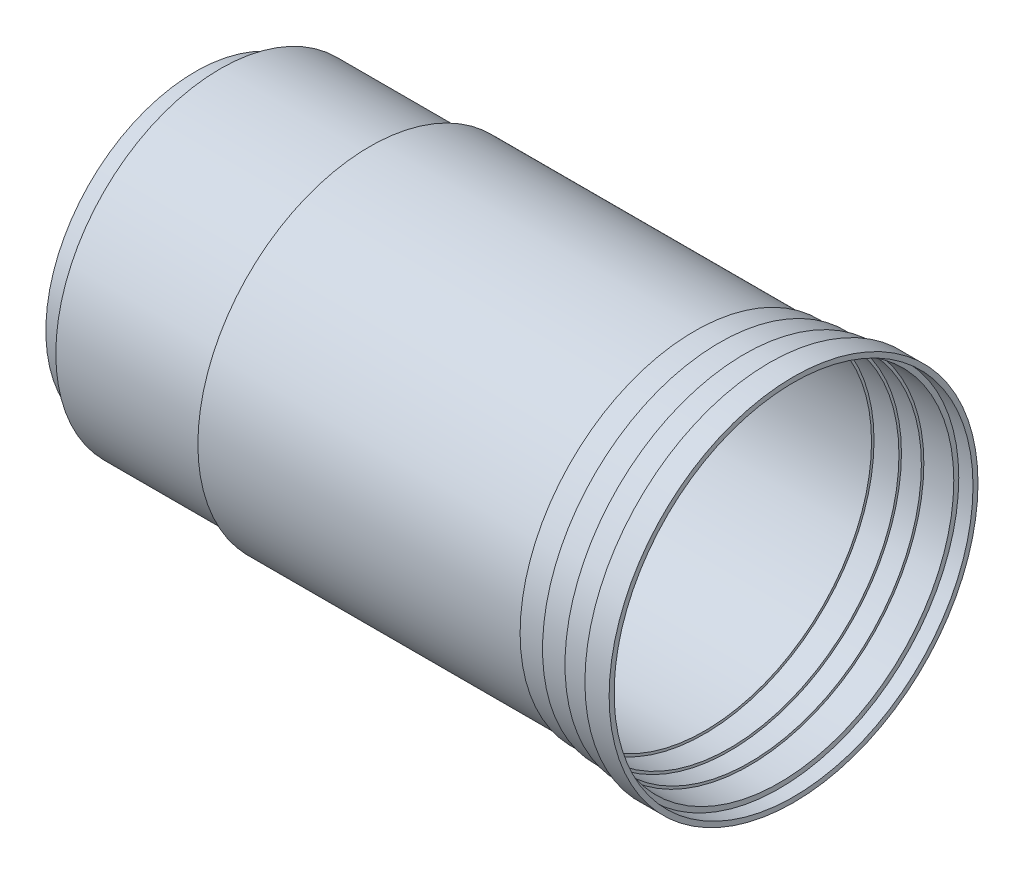
ISO-10303-21;
HEADER;
FILE_DESCRIPTION(('STEP AP214'),'2;1');
FILE_NAME('part.step','',(''),(''),'','','');
FILE_SCHEMA(('AUTOMOTIVE_DESIGN { 1 0 10303 214 1 1 1 1 }'));
ENDSEC;
DATA;
#1=APPLICATION_CONTEXT('core data for automotive mechanical design processes');
#2=APPLICATION_PROTOCOL_DEFINITION('international standard','automotive_design',2000,#1);
#3=PRODUCT_CONTEXT('',#1,'mechanical');
#4=PRODUCT('Part','Part','',(#3));
#5=PRODUCT_RELATED_PRODUCT_CATEGORY('part','',(#4));
#6=PRODUCT_DEFINITION_FORMATION('','',#4);
#7=PRODUCT_DEFINITION_CONTEXT('part definition',#1,'design');
#8=PRODUCT_DEFINITION('design','',#6,#7);
#9=PRODUCT_DEFINITION_SHAPE('','',#8);
#10=(LENGTH_UNIT() NAMED_UNIT(*) SI_UNIT(.MILLI.,.METRE.));
#11=(NAMED_UNIT(*) PLANE_ANGLE_UNIT() SI_UNIT($,.RADIAN.));
#12=(NAMED_UNIT(*) SI_UNIT($,.STERADIAN.) SOLID_ANGLE_UNIT());
#13=UNCERTAINTY_MEASURE_WITH_UNIT(LENGTH_MEASURE(1.E-05),#10,'distance_accuracy_value','');
#14=(GEOMETRIC_REPRESENTATION_CONTEXT(3) GLOBAL_UNCERTAINTY_ASSIGNED_CONTEXT((#13)) GLOBAL_UNIT_ASSIGNED_CONTEXT((#10,
#11,#12)) REPRESENTATION_CONTEXT('',''));
#15=CARTESIAN_POINT('',(0.,0.,0.));
#16=DIRECTION('',(0.,0.,1.));
#17=DIRECTION('',(1.,0.,0.));
#18=AXIS2_PLACEMENT_3D('',#15,#16,#17);
#19=CARTESIAN_POINT('',(-119.,0.,0.));
#20=DIRECTION('',(1.,0.,0.));
#21=DIRECTION('',(0.,0.,-1.));
#22=AXIS2_PLACEMENT_3D('',#19,#20,#21);
#23=PLANE('',#22);
#24=CARTESIAN_POINT('',(-119.,0.,0.));
#25=DIRECTION('',(1.,0.,0.));
#26=DIRECTION('',(0.,0.,-1.));
#27=AXIS2_PLACEMENT_3D('',#24,#25,#26);
#28=CIRCLE('',#27,29.);
#29=CARTESIAN_POINT('',(-119.,0.,-29.));
#30=VERTEX_POINT('',#29);
#31=EDGE_CURVE('E10',#30,#30,#28,.T.);
#32=ORIENTED_EDGE('',*,*,#31,.T.);
#33=EDGE_LOOP('',(#32));
#34=FACE_BOUND('',#33,.T.);
#35=ADVANCED_FACE('F32',(#34),#23,.T.);
#36=CARTESIAN_POINT('',(0.,0.,0.));
#37=DIRECTION('',(1.,0.,0.));
#38=DIRECTION('',(0.,0.,-1.));
#39=AXIS2_PLACEMENT_3D('',#36,#37,#38);
#40=CYLINDRICAL_SURFACE('',#39,29.);
#41=CARTESIAN_POINT('',(-114.,0.,0.));
#42=DIRECTION('',(1.,0.,0.));
#43=DIRECTION('',(0.,0.,-1.));
#44=AXIS2_PLACEMENT_3D('',#41,#42,#43);
#45=CIRCLE('',#44,29.);
#46=CARTESIAN_POINT('',(-114.,0.,-29.));
#47=VERTEX_POINT('',#46);
#48=EDGE_CURVE('E38',#47,#47,#45,.T.);
#49=ORIENTED_EDGE('',*,*,#48,.T.);
#50=EDGE_LOOP('',(#49));
#51=FACE_BOUND('',#50,.T.);
#52=ORIENTED_EDGE('',*,*,#31,.F.);
#53=EDGE_LOOP('',(#52));
#54=FACE_BOUND('',#53,.T.);
#55=ADVANCED_FACE('F136',(#51,#54),#40,.F.);
#56=CARTESIAN_POINT('',(-114.,29.,0.));
#57=DIRECTION('',(1.,0.,0.));
#58=DIRECTION('',(0.,0.,-1.));
#59=AXIS2_PLACEMENT_3D('',#56,#57,#58);
#60=PLANE('',#59);
#61=CARTESIAN_POINT('',(-114.,0.,0.));
#62=DIRECTION('',(1.,0.,0.));
#63=DIRECTION('',(0.,0.,-1.));
#64=AXIS2_PLACEMENT_3D('',#61,#62,#63);
#65=CIRCLE('',#64,32.);
#66=CARTESIAN_POINT('',(-114.,0.,-32.));
#67=VERTEX_POINT('',#66);
#68=EDGE_CURVE('E42',#67,#67,#65,.T.);
#69=ORIENTED_EDGE('',*,*,#68,.T.);
#70=EDGE_LOOP('',(#69));
#71=FACE_BOUND('',#70,.T.);
#72=ORIENTED_EDGE('',*,*,#48,.F.);
#73=EDGE_LOOP('',(#72));
#74=FACE_BOUND('',#73,.T.);
#75=ADVANCED_FACE('F140',(#71,#74),#60,.T.);
#76=CARTESIAN_POINT('',(0.,0.,0.));
#77=DIRECTION('',(1.,0.,0.));
#78=DIRECTION('',(0.,0.,-1.));
#79=AXIS2_PLACEMENT_3D('',#76,#77,#78);
#80=CYLINDRICAL_SURFACE('',#79,32.);
#81=CARTESIAN_POINT('',(-84.,0.,0.));
#82=DIRECTION('',(1.,0.,0.));
#83=DIRECTION('',(0.,0.,-1.));
#84=AXIS2_PLACEMENT_3D('',#81,#82,#83);
#85=CIRCLE('',#84,32.);
#86=CARTESIAN_POINT('',(-84.,0.,-32.));
#87=VERTEX_POINT('',#86);
#88=EDGE_CURVE('E46',#87,#87,#85,.T.);
#89=ORIENTED_EDGE('',*,*,#88,.T.);
#90=EDGE_LOOP('',(#89));
#91=FACE_BOUND('',#90,.T.);
#92=ORIENTED_EDGE('',*,*,#68,.F.);
#93=EDGE_LOOP('',(#92));
#94=FACE_BOUND('',#93,.T.);
#95=ADVANCED_FACE('F144',(#91,#94),#80,.F.);
#96=CARTESIAN_POINT('',(-84.,32.,0.));
#97=DIRECTION('',(1.,0.,0.));
#98=DIRECTION('',(0.,0.,-1.));
#99=AXIS2_PLACEMENT_3D('',#96,#97,#98);
#100=PLANE('',#99);
#101=CARTESIAN_POINT('',(-84.,0.,0.));
#102=DIRECTION('',(1.,0.,0.));
#103=DIRECTION('',(0.,0.,-1.));
#104=AXIS2_PLACEMENT_3D('',#101,#102,#103);
#105=CIRCLE('',#104,33.5);
#106=CARTESIAN_POINT('',(-84.,0.,-33.5));
#107=VERTEX_POINT('',#106);
#108=EDGE_CURVE('E51',#107,#107,#105,.T.);
#109=ORIENTED_EDGE('',*,*,#108,.T.);
#110=EDGE_LOOP('',(#109));
#111=FACE_BOUND('',#110,.T.);
#112=ORIENTED_EDGE('',*,*,#88,.F.);
#113=EDGE_LOOP('',(#112));
#114=FACE_BOUND('',#113,.T.);
#115=ADVANCED_FACE('F151',(#111,#114),#100,.T.);
#116=CARTESIAN_POINT('',(0.,0.,0.));
#117=DIRECTION('',(1.,0.,0.));
#118=DIRECTION('',(0.,0.,-1.));
#119=AXIS2_PLACEMENT_3D('',#116,#117,#118);
#120=CYLINDRICAL_SURFACE('',#119,33.5);
#121=CARTESIAN_POINT('',(-17.8572625441049,0.,0.));
#122=DIRECTION('',(1.,0.,0.));
#123=DIRECTION('',(0.,0.,-1.));
#124=AXIS2_PLACEMENT_3D('',#121,#122,#123);
#125=CIRCLE('',#124,33.5);
#126=CARTESIAN_POINT('',(-17.8572625441049,0.,-33.5));
#127=VERTEX_POINT('',#126);
#128=EDGE_CURVE('E54',#127,#127,#125,.T.);
#129=ORIENTED_EDGE('',*,*,#128,.T.);
#130=EDGE_LOOP('',(#129));
#131=FACE_BOUND('',#130,.T.);
#132=ORIENTED_EDGE('',*,*,#108,.F.);
#133=EDGE_LOOP('',(#132));
#134=FACE_BOUND('',#133,.T.);
#135=ADVANCED_FACE('F155',(#131,#134),#120,.F.);
#136=CARTESIAN_POINT('',(-17.8572625441049,33.5,0.));
#137=DIRECTION('',(1.,0.,0.));
#138=DIRECTION('',(0.,0.,-1.));
#139=AXIS2_PLACEMENT_3D('',#136,#137,#138);
#140=PLANE('',#139);
#141=CARTESIAN_POINT('',(-17.8572625441049,0.,0.));
#142=DIRECTION('',(1.,0.,0.));
#143=DIRECTION('',(0.,0.,-1.));
#144=AXIS2_PLACEMENT_3D('',#141,#142,#143);
#145=CIRCLE('',#144,34.);
#146=CARTESIAN_POINT('',(-17.8572625441049,0.,-34.));
#147=VERTEX_POINT('',#146);
#148=EDGE_CURVE('E57',#147,#147,#145,.T.);
#149=ORIENTED_EDGE('',*,*,#148,.T.);
#150=EDGE_LOOP('',(#149));
#151=FACE_BOUND('',#150,.T.);
#152=ORIENTED_EDGE('',*,*,#128,.F.);
#153=EDGE_LOOP('',(#152));
#154=FACE_BOUND('',#153,.T.);
#155=ADVANCED_FACE('F159',(#151,#154),#140,.T.);
#156=CARTESIAN_POINT('',(0.,0.,0.));
#157=DIRECTION('',(1.,0.,0.));
#158=DIRECTION('',(0.,0.,-1.));
#159=AXIS2_PLACEMENT_3D('',#156,#157,#158);
#160=CYLINDRICAL_SURFACE('',#159,34.);
#161=CARTESIAN_POINT('',(-12.8572625441049,0.,0.));
#162=DIRECTION('',(1.,0.,0.));
#163=DIRECTION('',(0.,0.,-1.));
#164=AXIS2_PLACEMENT_3D('',#161,#162,#163);
#165=CIRCLE('',#164,34.);
#166=CARTESIAN_POINT('',(-12.8572625441049,0.,-34.));
#167=VERTEX_POINT('',#166);
#168=EDGE_CURVE('E60',#167,#167,#165,.T.);
#169=ORIENTED_EDGE('',*,*,#168,.T.);
#170=EDGE_LOOP('',(#169));
#171=FACE_BOUND('',#170,.T.);
#172=ORIENTED_EDGE('',*,*,#148,.F.);
#173=EDGE_LOOP('',(#172));
#174=FACE_BOUND('',#173,.T.);
#175=ADVANCED_FACE('F163',(#171,#174),#160,.F.);
#176=CARTESIAN_POINT('',(-12.8572625441049,34.,0.));
#177=DIRECTION('',(1.,0.,0.));
#178=DIRECTION('',(0.,0.,-1.));
#179=AXIS2_PLACEMENT_3D('',#176,#177,#178);
#180=PLANE('',#179);
#181=CARTESIAN_POINT('',(-12.8572625441049,0.,0.));
#182=DIRECTION('',(1.,0.,0.));
#183=DIRECTION('',(0.,0.,-1.));
#184=AXIS2_PLACEMENT_3D('',#181,#182,#183);
#185=CIRCLE('',#184,34.5);
#186=CARTESIAN_POINT('',(-12.8572625441049,0.,-34.5));
#187=VERTEX_POINT('',#186);
#188=EDGE_CURVE('E63',#187,#187,#185,.T.);
#189=ORIENTED_EDGE('',*,*,#188,.T.);
#190=EDGE_LOOP('',(#189));
#191=FACE_BOUND('',#190,.T.);
#192=ORIENTED_EDGE('',*,*,#168,.F.);
#193=EDGE_LOOP('',(#192));
#194=FACE_BOUND('',#193,.T.);
#195=ADVANCED_FACE('F167',(#191,#194),#180,.T.);
#196=CARTESIAN_POINT('',(0.,0.,0.));
#197=DIRECTION('',(1.,0.,0.));
#198=DIRECTION('',(0.,0.,-1.));
#199=AXIS2_PLACEMENT_3D('',#196,#197,#198);
#200=CYLINDRICAL_SURFACE('',#199,34.5);
#201=CARTESIAN_POINT('',(-8.86309773650342,0.,0.));
#202=DIRECTION('',(1.,0.,0.));
#203=DIRECTION('',(0.,0.,-1.));
#204=AXIS2_PLACEMENT_3D('',#201,#202,#203);
#205=CIRCLE('',#204,34.5);
#206=CARTESIAN_POINT('',(-8.86309773650342,0.,-34.5));
#207=VERTEX_POINT('',#206);
#208=EDGE_CURVE('E66',#207,#207,#205,.T.);
#209=ORIENTED_EDGE('',*,*,#208,.T.);
#210=EDGE_LOOP('',(#209));
#211=FACE_BOUND('',#210,.T.);
#212=ORIENTED_EDGE('',*,*,#188,.F.);
#213=EDGE_LOOP('',(#212));
#214=FACE_BOUND('',#213,.T.);
#215=ADVANCED_FACE('F171',(#211,#214),#200,.F.);
#216=CARTESIAN_POINT('',(-8.86309773650342,34.5,0.));
#217=DIRECTION('',(1.,0.,0.));
#218=DIRECTION('',(0.,0.,-1.));
#219=AXIS2_PLACEMENT_3D('',#216,#217,#218);
#220=PLANE('',#219);
#221=CARTESIAN_POINT('',(-8.86309773650342,0.,0.));
#222=DIRECTION('',(1.,0.,0.));
#223=DIRECTION('',(0.,0.,-1.));
#224=AXIS2_PLACEMENT_3D('',#221,#222,#223);
#225=CIRCLE('',#224,35.);
#226=CARTESIAN_POINT('',(-8.86309773650342,0.,-35.));
#227=VERTEX_POINT('',#226);
#228=EDGE_CURVE('E69',#227,#227,#225,.T.);
#229=ORIENTED_EDGE('',*,*,#228,.T.);
#230=EDGE_LOOP('',(#229));
#231=FACE_BOUND('',#230,.T.);
#232=ORIENTED_EDGE('',*,*,#208,.F.);
#233=EDGE_LOOP('',(#232));
#234=FACE_BOUND('',#233,.T.);
#235=ADVANCED_FACE('F175',(#231,#234),#220,.T.);
#236=CARTESIAN_POINT('',(0.,0.,0.));
#237=DIRECTION('',(1.,0.,0.));
#238=DIRECTION('',(0.,0.,-1.));
#239=AXIS2_PLACEMENT_3D('',#236,#237,#238);
#240=CYLINDRICAL_SURFACE('',#239,35.);
#241=CARTESIAN_POINT('',(-2.85726254410496,0.,0.));
#242=DIRECTION('',(1.,0.,0.));
#243=DIRECTION('',(0.,0.,-1.));
#244=AXIS2_PLACEMENT_3D('',#241,#242,#243);
#245=CIRCLE('',#244,35.);
#246=CARTESIAN_POINT('',(-2.85726254410496,0.,-35.));
#247=VERTEX_POINT('',#246);
#248=EDGE_CURVE('E72',#247,#247,#245,.T.);
#249=ORIENTED_EDGE('',*,*,#248,.T.);
#250=EDGE_LOOP('',(#249));
#251=FACE_BOUND('',#250,.T.);
#252=ORIENTED_EDGE('',*,*,#228,.F.);
#253=EDGE_LOOP('',(#252));
#254=FACE_BOUND('',#253,.T.);
#255=ADVANCED_FACE('F179',(#251,#254),#240,.F.);
#256=CARTESIAN_POINT('',(-2.85726254410496,35.,0.));
#257=DIRECTION('',(1.,0.,0.));
#258=DIRECTION('',(0.,0.,-1.));
#259=AXIS2_PLACEMENT_3D('',#256,#257,#258);
#260=PLANE('',#259);
#261=CARTESIAN_POINT('',(-2.85726254410496,0.,0.));
#262=DIRECTION('',(1.,0.,0.));
#263=DIRECTION('',(0.,0.,-1.));
#264=AXIS2_PLACEMENT_3D('',#261,#262,#263);
#265=CIRCLE('',#264,36.);
#266=CARTESIAN_POINT('',(-2.85726254410496,0.,-36.));
#267=VERTEX_POINT('',#266);
#268=EDGE_CURVE('E75',#267,#267,#265,.T.);
#269=ORIENTED_EDGE('',*,*,#268,.T.);
#270=EDGE_LOOP('',(#269));
#271=FACE_BOUND('',#270,.T.);
#272=ORIENTED_EDGE('',*,*,#248,.F.);
#273=EDGE_LOOP('',(#272));
#274=FACE_BOUND('',#273,.T.);
#275=ADVANCED_FACE('F183',(#271,#274),#260,.T.);
#276=CARTESIAN_POINT('',(0.,0.,0.));
#277=DIRECTION('',(1.,0.,0.));
#278=DIRECTION('',(0.,0.,-1.));
#279=AXIS2_PLACEMENT_3D('',#276,#277,#278);
#280=CYLINDRICAL_SURFACE('',#279,36.);
#281=CARTESIAN_POINT('',(0.,0.,0.));
#282=DIRECTION('',(1.,0.,0.));
#283=DIRECTION('',(0.,0.,-1.));
#284=AXIS2_PLACEMENT_3D('',#281,#282,#283);
#285=CIRCLE('',#284,36.);
#286=CARTESIAN_POINT('',(0.,0.,-36.));
#287=VERTEX_POINT('',#286);
#288=EDGE_CURVE('E78',#287,#287,#285,.T.);
#289=ORIENTED_EDGE('',*,*,#288,.T.);
#290=EDGE_LOOP('',(#289));
#291=FACE_BOUND('',#290,.T.);
#292=ORIENTED_EDGE('',*,*,#268,.F.);
#293=EDGE_LOOP('',(#292));
#294=FACE_BOUND('',#293,.T.);
#295=ADVANCED_FACE('F187',(#291,#294),#280,.F.);
#296=CARTESIAN_POINT('',(0.,36.,0.));
#297=DIRECTION('',(1.,0.,0.));
#298=DIRECTION('',(0.,0.,-1.));
#299=AXIS2_PLACEMENT_3D('',#296,#297,#298);
#300=PLANE('',#299);
#301=CARTESIAN_POINT('',(0.,0.,0.));
#302=DIRECTION('',(1.,0.,0.));
#303=DIRECTION('',(0.,0.,-1.));
#304=AXIS2_PLACEMENT_3D('',#301,#302,#303);
#305=CIRCLE('',#304,37.);
#306=CARTESIAN_POINT('',(0.,0.,-37.));
#307=VERTEX_POINT('',#306);
#308=EDGE_CURVE('E81',#307,#307,#305,.T.);
#309=ORIENTED_EDGE('',*,*,#308,.T.);
#310=EDGE_LOOP('',(#309));
#311=FACE_BOUND('',#310,.T.);
#312=ORIENTED_EDGE('',*,*,#288,.F.);
#313=EDGE_LOOP('',(#312));
#314=FACE_BOUND('',#313,.T.);
#315=ADVANCED_FACE('F191',(#311,#314),#300,.T.);
#316=CARTESIAN_POINT('',(0.,0.,0.));
#317=DIRECTION('',(1.,0.,0.));
#318=DIRECTION('',(0.,0.,-1.));
#319=AXIS2_PLACEMENT_3D('',#316,#317,#318);
#320=CYLINDRICAL_SURFACE('',#319,37.);
#321=CARTESIAN_POINT('',(-4.85726254410496,0.,0.));
#322=DIRECTION('',(1.,0.,0.));
#323=DIRECTION('',(0.,0.,-1.));
#324=AXIS2_PLACEMENT_3D('',#321,#322,#323);
#325=CIRCLE('',#324,37.);
#326=CARTESIAN_POINT('',(-4.85726254410496,0.,-37.));
#327=VERTEX_POINT('',#326);
#328=EDGE_CURVE('E84',#327,#327,#325,.T.);
#329=ORIENTED_EDGE('',*,*,#328,.T.);
#330=EDGE_LOOP('',(#329));
#331=FACE_BOUND('',#330,.T.);
#332=ORIENTED_EDGE('',*,*,#308,.F.);
#333=EDGE_LOOP('',(#332));
#334=FACE_BOUND('',#333,.T.);
#335=ADVANCED_FACE('F195',(#331,#334),#320,.T.);
#336=CARTESIAN_POINT('',(-4.85726254410496,37.,0.));
#337=DIRECTION('',(-1.,0.,0.));
#338=DIRECTION('',(0.,0.,1.));
#339=AXIS2_PLACEMENT_3D('',#336,#337,#338);
#340=PLANE('',#339);
#341=CARTESIAN_POINT('',(-4.85726254410496,0.,0.));
#342=DIRECTION('',(1.,0.,0.));
#343=DIRECTION('',(0.,0.,-1.));
#344=AXIS2_PLACEMENT_3D('',#341,#342,#343);
#345=CIRCLE('',#344,36.);
#346=CARTESIAN_POINT('',(-4.85726254410496,0.,-36.));
#347=VERTEX_POINT('',#346);
#348=EDGE_CURVE('E87',#347,#347,#345,.T.);
#349=ORIENTED_EDGE('',*,*,#348,.T.);
#350=EDGE_LOOP('',(#349));
#351=FACE_BOUND('',#350,.T.);
#352=ORIENTED_EDGE('',*,*,#328,.F.);
#353=EDGE_LOOP('',(#352));
#354=FACE_BOUND('',#353,.T.);
#355=ADVANCED_FACE('F199',(#351,#354),#340,.T.);
#356=CARTESIAN_POINT('',(0.,0.,0.));
#357=DIRECTION('',(1.,0.,0.));
#358=DIRECTION('',(0.,0.,-1.));
#359=AXIS2_PLACEMENT_3D('',#356,#357,#358);
#360=CYLINDRICAL_SURFACE('',#359,36.);
#361=CARTESIAN_POINT('',(-9.85726254410496,0.,0.));
#362=DIRECTION('',(1.,0.,0.));
#363=DIRECTION('',(0.,0.,-1.));
#364=AXIS2_PLACEMENT_3D('',#361,#362,#363);
#365=CIRCLE('',#364,36.);
#366=CARTESIAN_POINT('',(-9.85726254410496,0.,-36.));
#367=VERTEX_POINT('',#366);
#368=EDGE_CURVE('E90',#367,#367,#365,.T.);
#369=ORIENTED_EDGE('',*,*,#368,.T.);
#370=EDGE_LOOP('',(#369));
#371=FACE_BOUND('',#370,.T.);
#372=ORIENTED_EDGE('',*,*,#348,.F.);
#373=EDGE_LOOP('',(#372));
#374=FACE_BOUND('',#373,.T.);
#375=ADVANCED_FACE('F203',(#371,#374),#360,.T.);
#376=CARTESIAN_POINT('',(-9.85726254410496,36.,0.));
#377=DIRECTION('',(-1.,0.,0.));
#378=DIRECTION('',(0.,0.,1.));
#379=AXIS2_PLACEMENT_3D('',#376,#377,#378);
#380=PLANE('',#379);
#381=CARTESIAN_POINT('',(-9.85726254410496,0.,0.));
#382=DIRECTION('',(1.,0.,0.));
#383=DIRECTION('',(0.,0.,-1.));
#384=AXIS2_PLACEMENT_3D('',#381,#382,#383);
#385=CIRCLE('',#384,35.5);
#386=CARTESIAN_POINT('',(-9.85726254410496,0.,-35.5));
#387=VERTEX_POINT('',#386);
#388=EDGE_CURVE('E93',#387,#387,#385,.T.);
#389=ORIENTED_EDGE('',*,*,#388,.T.);
#390=EDGE_LOOP('',(#389));
#391=FACE_BOUND('',#390,.T.);
#392=ORIENTED_EDGE('',*,*,#368,.F.);
#393=EDGE_LOOP('',(#392));
#394=FACE_BOUND('',#393,.T.);
#395=ADVANCED_FACE('F207',(#391,#394),#380,.T.);
#396=CARTESIAN_POINT('',(0.,0.,0.));
#397=DIRECTION('',(1.,0.,0.));
#398=DIRECTION('',(0.,0.,-1.));
#399=AXIS2_PLACEMENT_3D('',#396,#397,#398);
#400=CYLINDRICAL_SURFACE('',#399,35.5);
#401=CARTESIAN_POINT('',(-14.857262544105,0.,0.));
#402=DIRECTION('',(1.,0.,0.));
#403=DIRECTION('',(0.,0.,-1.));
#404=AXIS2_PLACEMENT_3D('',#401,#402,#403);
#405=CIRCLE('',#404,35.5);
#406=CARTESIAN_POINT('',(-14.857262544105,0.,-35.5));
#407=VERTEX_POINT('',#406);
#408=EDGE_CURVE('E96',#407,#407,#405,.T.);
#409=ORIENTED_EDGE('',*,*,#408,.T.);
#410=EDGE_LOOP('',(#409));
#411=FACE_BOUND('',#410,.T.);
#412=ORIENTED_EDGE('',*,*,#388,.F.);
#413=EDGE_LOOP('',(#412));
#414=FACE_BOUND('',#413,.T.);
#415=ADVANCED_FACE('F211',(#411,#414),#400,.T.);
#416=CARTESIAN_POINT('',(-14.8572625441049,35.5,0.));
#417=DIRECTION('',(-1.,0.,0.));
#418=DIRECTION('',(0.,0.,1.));
#419=AXIS2_PLACEMENT_3D('',#416,#417,#418);
#420=PLANE('',#419);
#421=CARTESIAN_POINT('',(-14.8572625441049,0.,0.));
#422=DIRECTION('',(1.,0.,0.));
#423=DIRECTION('',(0.,0.,-1.));
#424=AXIS2_PLACEMENT_3D('',#421,#422,#423);
#425=CIRCLE('',#424,35.);
#426=CARTESIAN_POINT('',(-14.8572625441049,0.,-35.));
#427=VERTEX_POINT('',#426);
#428=EDGE_CURVE('E99',#427,#427,#425,.T.);
#429=ORIENTED_EDGE('',*,*,#428,.T.);
#430=EDGE_LOOP('',(#429));
#431=FACE_BOUND('',#430,.T.);
#432=ORIENTED_EDGE('',*,*,#408,.F.);
#433=EDGE_LOOP('',(#432));
#434=FACE_BOUND('',#433,.T.);
#435=ADVANCED_FACE('F215',(#431,#434),#420,.T.);
#436=CARTESIAN_POINT('',(0.,0.,0.));
#437=DIRECTION('',(1.,0.,0.));
#438=DIRECTION('',(0.,0.,-1.));
#439=AXIS2_PLACEMENT_3D('',#436,#437,#438);
#440=CYLINDRICAL_SURFACE('',#439,35.);
#441=CARTESIAN_POINT('',(-19.8572625441049,0.,0.));
#442=DIRECTION('',(1.,0.,0.));
#443=DIRECTION('',(0.,0.,-1.));
#444=AXIS2_PLACEMENT_3D('',#441,#442,#443);
#445=CIRCLE('',#444,35.);
#446=CARTESIAN_POINT('',(-19.8572625441049,0.,-35.));
#447=VERTEX_POINT('',#446);
#448=EDGE_CURVE('E102',#447,#447,#445,.T.);
#449=ORIENTED_EDGE('',*,*,#448,.T.);
#450=EDGE_LOOP('',(#449));
#451=FACE_BOUND('',#450,.T.);
#452=ORIENTED_EDGE('',*,*,#428,.F.);
#453=EDGE_LOOP('',(#452));
#454=FACE_BOUND('',#453,.T.);
#455=ADVANCED_FACE('F219',(#451,#454),#440,.T.);
#456=CARTESIAN_POINT('',(-19.8572625441049,35.,0.));
#457=DIRECTION('',(-1.,0.,0.));
#458=DIRECTION('',(0.,0.,1.));
#459=AXIS2_PLACEMENT_3D('',#456,#457,#458);
#460=PLANE('',#459);
#461=CARTESIAN_POINT('',(-19.8572625441049,0.,0.));
#462=DIRECTION('',(1.,0.,0.));
#463=DIRECTION('',(0.,0.,-1.));
#464=AXIS2_PLACEMENT_3D('',#461,#462,#463);
#465=CIRCLE('',#464,34.5);
#466=CARTESIAN_POINT('',(-19.8572625441049,0.,-34.5));
#467=VERTEX_POINT('',#466);
#468=EDGE_CURVE('E105',#467,#467,#465,.T.);
#469=ORIENTED_EDGE('',*,*,#468,.T.);
#470=EDGE_LOOP('',(#469));
#471=FACE_BOUND('',#470,.T.);
#472=ORIENTED_EDGE('',*,*,#448,.F.);
#473=EDGE_LOOP('',(#472));
#474=FACE_BOUND('',#473,.T.);
#475=ADVANCED_FACE('F223',(#471,#474),#460,.T.);
#476=CARTESIAN_POINT('',(0.,0.,0.));
#477=DIRECTION('',(1.,0.,0.));
#478=DIRECTION('',(0.,0.,-1.));
#479=AXIS2_PLACEMENT_3D('',#476,#477,#478);
#480=CYLINDRICAL_SURFACE('',#479,34.5);
#481=CARTESIAN_POINT('',(-85.,0.,0.));
#482=DIRECTION('',(1.,0.,0.));
#483=DIRECTION('',(0.,0.,-1.));
#484=AXIS2_PLACEMENT_3D('',#481,#482,#483);
#485=CIRCLE('',#484,34.5);
#486=CARTESIAN_POINT('',(-85.,0.,-34.5));
#487=VERTEX_POINT('',#486);
#488=EDGE_CURVE('E108',#487,#487,#485,.T.);
#489=ORIENTED_EDGE('',*,*,#488,.T.);
#490=EDGE_LOOP('',(#489));
#491=FACE_BOUND('',#490,.T.);
#492=ORIENTED_EDGE('',*,*,#468,.F.);
#493=EDGE_LOOP('',(#492));
#494=FACE_BOUND('',#493,.T.);
#495=ADVANCED_FACE('F227',(#491,#494),#480,.T.);
#496=CARTESIAN_POINT('',(-85.,34.5,0.));
#497=DIRECTION('',(-1.,0.,0.));
#498=DIRECTION('',(0.,0.,1.));
#499=AXIS2_PLACEMENT_3D('',#496,#497,#498);
#500=PLANE('',#499);
#501=CARTESIAN_POINT('',(-85.,0.,0.));
#502=DIRECTION('',(1.,0.,0.));
#503=DIRECTION('',(0.,0.,-1.));
#504=AXIS2_PLACEMENT_3D('',#501,#502,#503);
#505=CIRCLE('',#504,33.);
#506=CARTESIAN_POINT('',(-85.,0.,-33.));
#507=VERTEX_POINT('',#506);
#508=EDGE_CURVE('E111',#507,#507,#505,.T.);
#509=ORIENTED_EDGE('',*,*,#508,.T.);
#510=EDGE_LOOP('',(#509));
#511=FACE_BOUND('',#510,.T.);
#512=ORIENTED_EDGE('',*,*,#488,.F.);
#513=EDGE_LOOP('',(#512));
#514=FACE_BOUND('',#513,.T.);
#515=ADVANCED_FACE('F231',(#511,#514),#500,.T.);
#516=CARTESIAN_POINT('',(0.,0.,0.));
#517=DIRECTION('',(1.,0.,0.));
#518=DIRECTION('',(0.,0.,-1.));
#519=AXIS2_PLACEMENT_3D('',#516,#517,#518);
#520=CYLINDRICAL_SURFACE('',#519,33.);
#521=CARTESIAN_POINT('',(-115.,0.,0.));
#522=DIRECTION('',(1.,0.,0.));
#523=DIRECTION('',(0.,0.,-1.));
#524=AXIS2_PLACEMENT_3D('',#521,#522,#523);
#525=CIRCLE('',#524,33.);
#526=CARTESIAN_POINT('',(-115.,0.,-33.));
#527=VERTEX_POINT('',#526);
#528=EDGE_CURVE('E114',#527,#527,#525,.T.);
#529=ORIENTED_EDGE('',*,*,#528,.T.);
#530=EDGE_LOOP('',(#529));
#531=FACE_BOUND('',#530,.T.);
#532=ORIENTED_EDGE('',*,*,#508,.F.);
#533=EDGE_LOOP('',(#532));
#534=FACE_BOUND('',#533,.T.);
#535=ADVANCED_FACE('F235',(#531,#534),#520,.T.);
#536=CARTESIAN_POINT('',(-115.,30.,0.));
#537=DIRECTION('',(-1.,0.,0.));
#538=DIRECTION('',(0.,0.,1.));
#539=AXIS2_PLACEMENT_3D('',#536,#537,#538);
#540=PLANE('',#539);
#541=CARTESIAN_POINT('',(-115.,0.,0.));
#542=DIRECTION('',(1.,0.,0.));
#543=DIRECTION('',(0.,0.,-1.));
#544=AXIS2_PLACEMENT_3D('',#541,#542,#543);
#545=CIRCLE('',#544,30.);
#546=CARTESIAN_POINT('',(-115.,0.,-30.));
#547=VERTEX_POINT('',#546);
#548=EDGE_CURVE('E117',#547,#547,#545,.T.);
#549=ORIENTED_EDGE('',*,*,#548,.T.);
#550=EDGE_LOOP('',(#549));
#551=FACE_BOUND('',#550,.T.);
#552=ORIENTED_EDGE('',*,*,#528,.F.);
#553=EDGE_LOOP('',(#552));
#554=FACE_BOUND('',#553,.T.);
#555=ADVANCED_FACE('F133',(#551,#554),#540,.T.);
#556=CARTESIAN_POINT('',(0.,0.,0.));
#557=DIRECTION('',(1.,0.,0.));
#558=DIRECTION('',(0.,0.,-1.));
#559=AXIS2_PLACEMENT_3D('',#556,#557,#558);
#560=CYLINDRICAL_SURFACE('',#559,30.);
#561=CARTESIAN_POINT('',(-120.,0.,0.));
#562=DIRECTION('',(1.,0.,0.));
#563=DIRECTION('',(0.,0.,-1.));
#564=AXIS2_PLACEMENT_3D('',#561,#562,#563);
#565=CIRCLE('',#564,30.);
#566=CARTESIAN_POINT('',(-120.,0.,-30.));
#567=VERTEX_POINT('',#566);
#568=EDGE_CURVE('E120',#567,#567,#565,.T.);
#569=ORIENTED_EDGE('',*,*,#568,.T.);
#570=EDGE_LOOP('',(#569));
#571=FACE_BOUND('',#570,.T.);
#572=ORIENTED_EDGE('',*,*,#548,.F.);
#573=EDGE_LOOP('',(#572));
#574=FACE_BOUND('',#573,.T.);
#575=ADVANCED_FACE('F124',(#571,#574),#560,.T.);
#576=CARTESIAN_POINT('',(-120.,0.,0.));
#577=DIRECTION('',(-1.,0.,0.));
#578=DIRECTION('',(0.,0.,1.));
#579=AXIS2_PLACEMENT_3D('',#576,#577,#578);
#580=PLANE('',#579);
#581=ORIENTED_EDGE('',*,*,#568,.F.);
#582=EDGE_LOOP('',(#581));
#583=FACE_BOUND('',#582,.T.);
#584=ADVANCED_FACE('F127',(#583),#580,.T.);
#585=CLOSED_SHELL('',(#35,#55,#75,#95,#115,#135,#155,#175,#195,#215,#235,#255,#275,#295,#315,
#335,#355,#375,#395,#415,#435,#455,#475,#495,#515,#535,#555,#575,#584));
#586=MANIFOLD_SOLID_BREP('B2',#585);
#587=ADVANCED_BREP_SHAPE_REPRESENTATION('',(#18,#586),#14);
#588=SHAPE_DEFINITION_REPRESENTATION(#9,#587);
ENDSEC;
END-ISO-10303-21;
